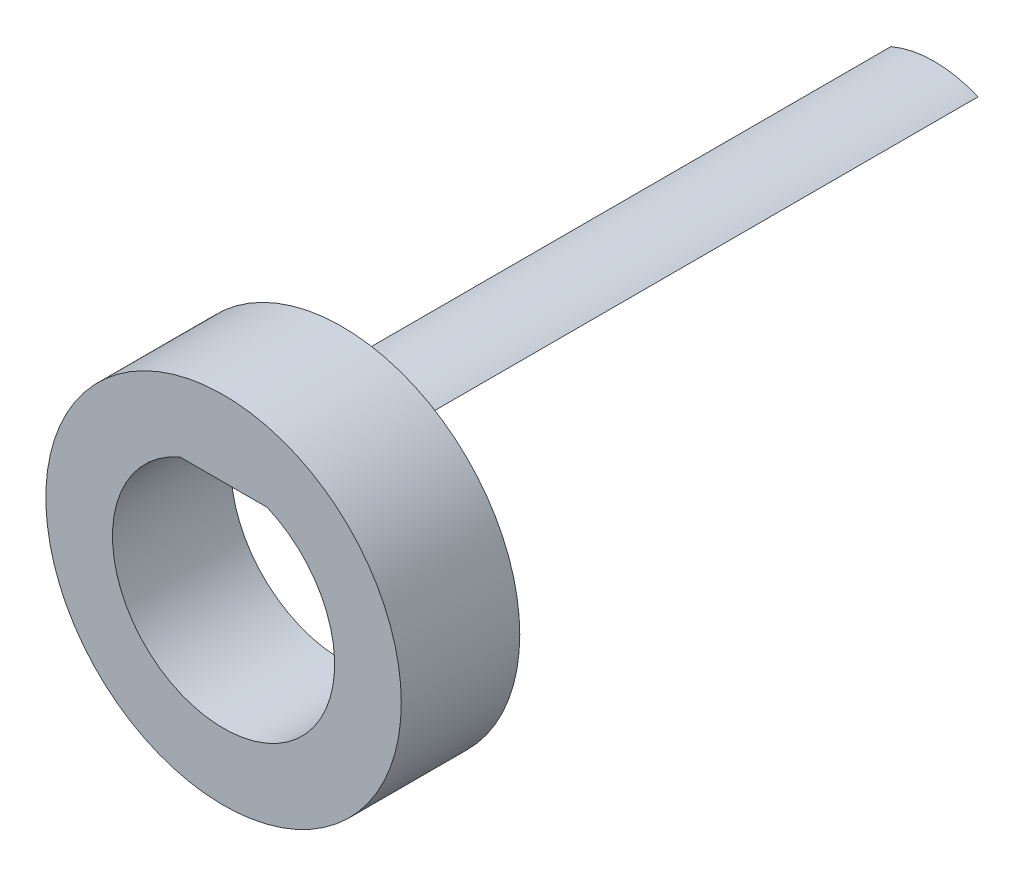
ISO-10303-21;
HEADER;
FILE_DESCRIPTION(('STEP AP214'),'2;1');
FILE_NAME('part.step','',(''),(''),'','','');
FILE_SCHEMA(('AUTOMOTIVE_DESIGN { 1 0 10303 214 1 1 1 1 }'));
ENDSEC;
DATA;
#1=APPLICATION_CONTEXT('core data for automotive mechanical design processes');
#2=APPLICATION_PROTOCOL_DEFINITION('international standard','automotive_design',2000,#1);
#3=PRODUCT_CONTEXT('',#1,'mechanical');
#4=PRODUCT('Part','Part','',(#3));
#5=PRODUCT_RELATED_PRODUCT_CATEGORY('part','',(#4));
#6=PRODUCT_DEFINITION_FORMATION('','',#4);
#7=PRODUCT_DEFINITION_CONTEXT('part definition',#1,'design');
#8=PRODUCT_DEFINITION('design','',#6,#7);
#9=PRODUCT_DEFINITION_SHAPE('','',#8);
#10=(LENGTH_UNIT() NAMED_UNIT(*) SI_UNIT(.MILLI.,.METRE.));
#11=(NAMED_UNIT(*) PLANE_ANGLE_UNIT() SI_UNIT($,.RADIAN.));
#12=(NAMED_UNIT(*) SI_UNIT($,.STERADIAN.) SOLID_ANGLE_UNIT());
#13=UNCERTAINTY_MEASURE_WITH_UNIT(LENGTH_MEASURE(1.E-05),#10,'distance_accuracy_value','');
#14=(GEOMETRIC_REPRESENTATION_CONTEXT(3) GLOBAL_UNCERTAINTY_ASSIGNED_CONTEXT((#13)) GLOBAL_UNIT_ASSIGNED_CONTEXT((#10,
#11,#12)) REPRESENTATION_CONTEXT('',''));
#15=CARTESIAN_POINT('',(0.,0.,0.));
#16=DIRECTION('',(0.,0.,1.));
#17=DIRECTION('',(1.,0.,0.));
#18=AXIS2_PLACEMENT_3D('',#15,#16,#17);
#19=CARTESIAN_POINT('',(0.,0.,2.54));
#20=DIRECTION('',(0.,0.,1.));
#21=DIRECTION('',(1.,0.,0.));
#22=AXIS2_PLACEMENT_3D('',#19,#20,#21);
#23=PLANE('',#22);
#24=CARTESIAN_POINT('',(0.,0.,2.54));
#25=DIRECTION('',(0.,0.,1.));
#26=DIRECTION('',(1.,0.,0.));
#27=AXIS2_PLACEMENT_3D('',#24,#25,#26);
#28=CIRCLE('',#27,3.81);
#29=CARTESIAN_POINT('',(3.81,0.,2.54));
#30=VERTEX_POINT('',#29);
#31=EDGE_CURVE('E11',#30,#30,#28,.T.);
#32=ORIENTED_EDGE('',*,*,#31,.T.);
#33=EDGE_LOOP('',(#32));
#34=FACE_BOUND('',#33,.T.);
#35=DIRECTION('',(-1.,0.,0.));
#36=VECTOR('',#35,1.);
#37=CARTESIAN_POINT('',(-0.933255592000391,2.19075,2.54));
#38=LINE('',#37,#36);
#39=CARTESIAN_POINT('',(0.933255592000391,2.19075,2.54));
#40=VERTEX_POINT('',#39);
#41=CARTESIAN_POINT('',(-0.933255592000391,2.19075,2.54));
#42=VERTEX_POINT('',#41);
#43=EDGE_CURVE('E104',#40,#42,#38,.T.);
#44=ORIENTED_EDGE('',*,*,#43,.F.);
#45=CARTESIAN_POINT('',(0.,0.,2.54));
#46=DIRECTION('',(0.,0.,1.));
#47=DIRECTION('',(1.,0.,0.));
#48=AXIS2_PLACEMENT_3D('',#45,#46,#47);
#49=CIRCLE('',#48,2.38125);
#50=EDGE_CURVE('E97',#42,#40,#49,.T.);
#51=ORIENTED_EDGE('',*,*,#50,.F.);
#52=EDGE_LOOP('',(#44,#51));
#53=FACE_BOUND('',#52,.T.);
#54=ADVANCED_FACE('F39',(#34,#53),#23,.T.);
#55=CARTESIAN_POINT('',(0.,0.,0.));
#56=DIRECTION('',(0.,0.,1.));
#57=DIRECTION('',(1.,0.,0.));
#58=AXIS2_PLACEMENT_3D('',#55,#56,#57);
#59=PLANE('',#58);
#60=CARTESIAN_POINT('',(0.,0.,0.));
#61=DIRECTION('',(0.,0.,-1.));
#62=DIRECTION('',(-1.,0.,0.));
#63=AXIS2_PLACEMENT_3D('',#60,#61,#62);
#64=CIRCLE('',#63,2.38125);
#65=CARTESIAN_POINT('',(-0.933255592000391,2.19075,0.));
#66=VERTEX_POINT('',#65);
#67=CARTESIAN_POINT('',(0.933255592000391,2.19075,0.));
#68=VERTEX_POINT('',#67);
#69=EDGE_CURVE('E62',#66,#68,#64,.T.);
#70=ORIENTED_EDGE('',*,*,#69,.F.);
#71=CARTESIAN_POINT('',(0.,0.,0.));
#72=DIRECTION('',(0.,0.,1.));
#73=DIRECTION('',(1.,0.,0.));
#74=AXIS2_PLACEMENT_3D('',#71,#72,#73);
#75=CIRCLE('',#74,2.38125);
#76=EDGE_CURVE('E93',#66,#68,#75,.T.);
#77=ORIENTED_EDGE('',*,*,#76,.T.);
#78=EDGE_LOOP('',(#70,#77));
#79=FACE_BOUND('',#78,.T.);
#80=CARTESIAN_POINT('',(0.,0.,0.));
#81=DIRECTION('',(0.,0.,1.));
#82=DIRECTION('',(1.,0.,0.));
#83=AXIS2_PLACEMENT_3D('',#80,#81,#82);
#84=CIRCLE('',#83,3.81);
#85=CARTESIAN_POINT('',(3.81,0.,0.));
#86=VERTEX_POINT('',#85);
#87=EDGE_CURVE('E43',#86,#86,#84,.T.);
#88=ORIENTED_EDGE('',*,*,#87,.F.);
#89=EDGE_LOOP('',(#88));
#90=FACE_BOUND('',#89,.T.);
#91=ADVANCED_FACE('F117',(#79,#90),#59,.F.);
#92=CARTESIAN_POINT('',(0.,0.,2.54));
#93=DIRECTION('',(0.,0.,-1.));
#94=DIRECTION('',(-1.,0.,0.));
#95=AXIS2_PLACEMENT_3D('',#92,#93,#94);
#96=CYLINDRICAL_SURFACE('',#95,3.81);
#97=ORIENTED_EDGE('',*,*,#31,.F.);
#98=EDGE_LOOP('',(#97));
#99=FACE_BOUND('',#98,.T.);
#100=ORIENTED_EDGE('',*,*,#87,.T.);
#101=EDGE_LOOP('',(#100));
#102=FACE_BOUND('',#101,.T.);
#103=ADVANCED_FACE('F41',(#99,#102),#96,.T.);
#104=CARTESIAN_POINT('',(0.,0.,2.54));
#105=DIRECTION('',(0.,0.,-1.));
#106=DIRECTION('',(-1.,0.,0.));
#107=AXIS2_PLACEMENT_3D('',#104,#105,#106);
#108=CYLINDRICAL_SURFACE('',#107,2.38125);
#109=ORIENTED_EDGE('',*,*,#76,.F.);
#110=DIRECTION('',(0.,0.,-1.));
#111=VECTOR('',#110,1.);
#112=CARTESIAN_POINT('',(-0.933255592000391,2.19075,2.54));
#113=LINE('',#112,#111);
#114=EDGE_CURVE('E106',#42,#66,#113,.T.);
#115=ORIENTED_EDGE('',*,*,#114,.F.);
#116=ORIENTED_EDGE('',*,*,#50,.T.);
#117=DIRECTION('',(0.,0.,-1.));
#118=VECTOR('',#117,1.);
#119=CARTESIAN_POINT('',(0.933255592000391,2.19075,2.54));
#120=LINE('',#119,#118);
#121=EDGE_CURVE('E55',#40,#68,#120,.T.);
#122=ORIENTED_EDGE('',*,*,#121,.T.);
#123=EDGE_LOOP('',(#109,#115,#116,#122));
#124=FACE_BOUND('',#123,.T.);
#125=ADVANCED_FACE('F123',(#124),#108,.F.);
#126=CARTESIAN_POINT('',(-0.933255592000391,2.19075,2.54));
#127=DIRECTION('',(0.,-1.,0.));
#128=DIRECTION('',(0.,0.,-1.));
#129=AXIS2_PLACEMENT_3D('',#126,#127,#128);
#130=PLANE('',#129);
#131=ORIENTED_EDGE('',*,*,#114,.T.);
#132=DIRECTION('',(0.,0.,1.));
#133=VECTOR('',#132,1.);
#134=CARTESIAN_POINT('',(-0.933255592000391,2.19075,-12.7));
#135=LINE('',#134,#133);
#136=CARTESIAN_POINT('',(-0.933255592000391,2.19075,-12.7));
#137=VERTEX_POINT('',#136);
#138=EDGE_CURVE('E81',#137,#66,#135,.T.);
#139=ORIENTED_EDGE('',*,*,#138,.F.);
#140=DIRECTION('',(-1.,0.,0.));
#141=VECTOR('',#140,1.);
#142=CARTESIAN_POINT('',(0.933255592000391,2.19075,-12.7));
#143=LINE('',#142,#141);
#144=CARTESIAN_POINT('',(0.933255592000391,2.19075,-12.7));
#145=VERTEX_POINT('',#144);
#146=EDGE_CURVE('E74',#145,#137,#143,.T.);
#147=ORIENTED_EDGE('',*,*,#146,.F.);
#148=DIRECTION('',(0.,0.,1.));
#149=VECTOR('',#148,1.);
#150=CARTESIAN_POINT('',(0.933255592000391,2.19075,-12.7));
#151=LINE('',#150,#149);
#152=EDGE_CURVE('E79',#145,#68,#151,.T.);
#153=ORIENTED_EDGE('',*,*,#152,.T.);
#154=ORIENTED_EDGE('',*,*,#121,.F.);
#155=ORIENTED_EDGE('',*,*,#43,.T.);
#156=EDGE_LOOP('',(#131,#139,#147,#153,#154,#155));
#157=FACE_BOUND('',#156,.T.);
#158=ADVANCED_FACE('F77',(#157),#130,.T.);
#159=CARTESIAN_POINT('',(0.,0.,-12.7));
#160=DIRECTION('',(0.,0.,1.));
#161=DIRECTION('',(1.,0.,0.));
#162=AXIS2_PLACEMENT_3D('',#159,#160,#161);
#163=CYLINDRICAL_SURFACE('',#162,2.38125);
#164=ORIENTED_EDGE('',*,*,#69,.T.);
#165=ORIENTED_EDGE('',*,*,#152,.F.);
#166=CARTESIAN_POINT('',(0.,0.,-12.7));
#167=DIRECTION('',(0.,0.,-1.));
#168=DIRECTION('',(-1.,0.,0.));
#169=AXIS2_PLACEMENT_3D('',#166,#167,#168);
#170=CIRCLE('',#169,2.38125);
#171=EDGE_CURVE('E85',#137,#145,#170,.T.);
#172=ORIENTED_EDGE('',*,*,#171,.F.);
#173=ORIENTED_EDGE('',*,*,#138,.T.);
#174=EDGE_LOOP('',(#164,#165,#172,#173));
#175=FACE_BOUND('',#174,.T.);
#176=ADVANCED_FACE('F91',(#175),#163,.T.);
#177=CARTESIAN_POINT('',(0.,0.,-12.7));
#178=DIRECTION('',(0.,0.,-1.));
#179=DIRECTION('',(-1.,0.,0.));
#180=AXIS2_PLACEMENT_3D('',#177,#178,#179);
#181=PLANE('',#180);
#182=ORIENTED_EDGE('',*,*,#171,.T.);
#183=ORIENTED_EDGE('',*,*,#146,.T.);
#184=EDGE_LOOP('',(#182,#183));
#185=FACE_BOUND('',#184,.T.);
#186=ADVANCED_FACE('F87',(#185),#181,.T.);
#187=CLOSED_SHELL('',(#54,#91,#103,#125,#158,#176,#186));
#188=MANIFOLD_SOLID_BREP('B2',#187);
#189=ADVANCED_BREP_SHAPE_REPRESENTATION('',(#18,#188),#14);
#190=SHAPE_DEFINITION_REPRESENTATION(#9,#189);
ENDSEC;
END-ISO-10303-21;
